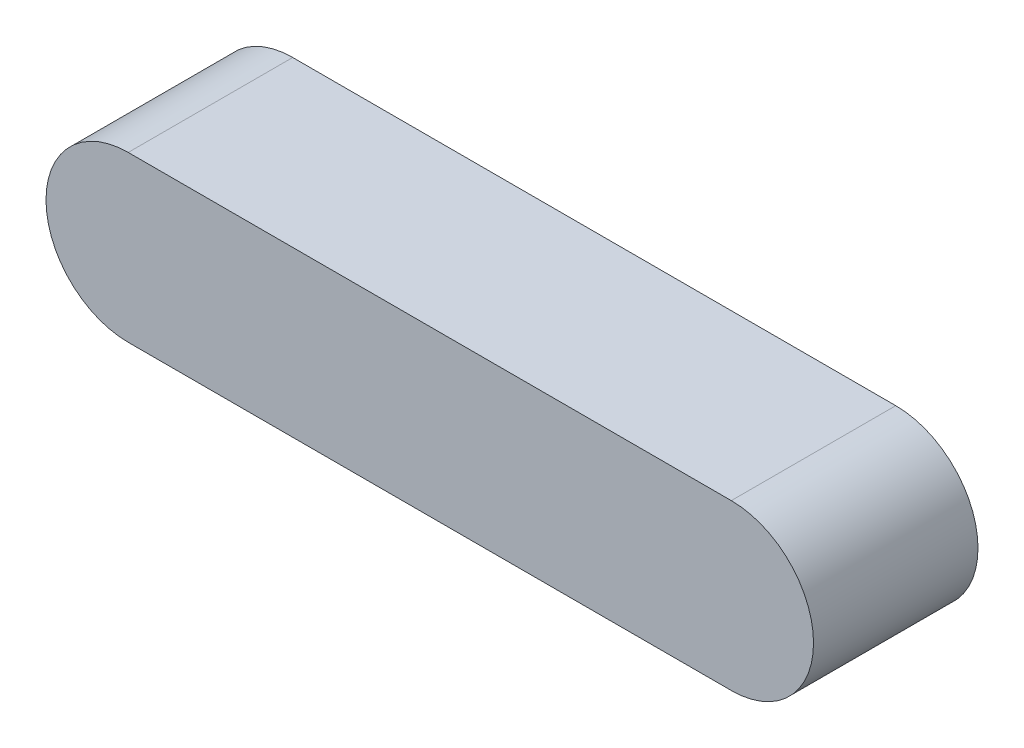
ISO-10303-21;
HEADER;
FILE_DESCRIPTION(('STEP AP214'),'2;1');
FILE_NAME('part.step','',(''),(''),'','','');
FILE_SCHEMA(('AUTOMOTIVE_DESIGN { 1 0 10303 214 1 1 1 1 }'));
ENDSEC;
DATA;
#1=APPLICATION_CONTEXT('core data for automotive mechanical design processes');
#2=APPLICATION_PROTOCOL_DEFINITION('international standard','automotive_design',2000,#1);
#3=PRODUCT_CONTEXT('',#1,'mechanical');
#4=PRODUCT('Part','Part','',(#3));
#5=PRODUCT_RELATED_PRODUCT_CATEGORY('part','',(#4));
#6=PRODUCT_DEFINITION_FORMATION('','',#4);
#7=PRODUCT_DEFINITION_CONTEXT('part definition',#1,'design');
#8=PRODUCT_DEFINITION('design','',#6,#7);
#9=PRODUCT_DEFINITION_SHAPE('','',#8);
#10=(LENGTH_UNIT() NAMED_UNIT(*) SI_UNIT(.MILLI.,.METRE.));
#11=(NAMED_UNIT(*) PLANE_ANGLE_UNIT() SI_UNIT($,.RADIAN.));
#12=(NAMED_UNIT(*) SI_UNIT($,.STERADIAN.) SOLID_ANGLE_UNIT());
#13=UNCERTAINTY_MEASURE_WITH_UNIT(LENGTH_MEASURE(1.E-05),#10,'distance_accuracy_value','');
#14=(GEOMETRIC_REPRESENTATION_CONTEXT(3) GLOBAL_UNCERTAINTY_ASSIGNED_CONTEXT((#13)) GLOBAL_UNIT_ASSIGNED_CONTEXT((#10,
#11,#12)) REPRESENTATION_CONTEXT('',''));
#15=CARTESIAN_POINT('',(0.,0.,0.));
#16=DIRECTION('',(0.,0.,1.));
#17=DIRECTION('',(1.,0.,0.));
#18=AXIS2_PLACEMENT_3D('',#15,#16,#17);
#19=CARTESIAN_POINT('',(-5.5,0.,3.));
#20=DIRECTION('',(0.,0.,-1.));
#21=DIRECTION('',(-1.,0.,0.));
#22=AXIS2_PLACEMENT_3D('',#19,#20,#21);
#23=CYLINDRICAL_SURFACE('',#22,1.5);
#24=CARTESIAN_POINT('',(-5.5,0.,0.));
#25=DIRECTION('',(0.,0.,1.));
#26=DIRECTION('',(1.,0.,0.));
#27=AXIS2_PLACEMENT_3D('',#24,#25,#26);
#28=CIRCLE('',#27,1.5);
#29=CARTESIAN_POINT('',(-5.5,1.5,0.));
#30=VERTEX_POINT('',#29);
#31=CARTESIAN_POINT('',(-5.5,-1.5,0.));
#32=VERTEX_POINT('',#31);
#33=EDGE_CURVE('E96',#30,#32,#28,.T.);
#34=ORIENTED_EDGE('',*,*,#33,.T.);
#35=DIRECTION('',(0.,0.,-1.));
#36=VECTOR('',#35,1.);
#37=CARTESIAN_POINT('',(-5.5,-1.5,3.));
#38=LINE('',#37,#36);
#39=CARTESIAN_POINT('',(-5.5,-1.5,3.));
#40=VERTEX_POINT('',#39);
#41=EDGE_CURVE('E11',#40,#32,#38,.T.);
#42=ORIENTED_EDGE('',*,*,#41,.F.);
#43=CARTESIAN_POINT('',(-5.5,0.,3.));
#44=DIRECTION('',(0.,0.,1.));
#45=DIRECTION('',(1.,0.,0.));
#46=AXIS2_PLACEMENT_3D('',#43,#44,#45);
#47=CIRCLE('',#46,1.5);
#48=CARTESIAN_POINT('',(-5.5,1.5,3.));
#49=VERTEX_POINT('',#48);
#50=EDGE_CURVE('E84',#49,#40,#47,.T.);
#51=ORIENTED_EDGE('',*,*,#50,.F.);
#52=DIRECTION('',(0.,0.,-1.));
#53=VECTOR('',#52,1.);
#54=CARTESIAN_POINT('',(-5.5,1.5,3.));
#55=LINE('',#54,#53);
#56=EDGE_CURVE('E92',#49,#30,#55,.T.);
#57=ORIENTED_EDGE('',*,*,#56,.T.);
#58=EDGE_LOOP('',(#34,#42,#51,#57));
#59=FACE_BOUND('',#58,.T.);
#60=ADVANCED_FACE('F33',(#59),#23,.T.);
#61=CARTESIAN_POINT('',(-5.5,-1.5,3.));
#62=DIRECTION('',(0.,1.,0.));
#63=DIRECTION('',(-1.,0.,0.));
#64=AXIS2_PLACEMENT_3D('',#61,#62,#63);
#65=PLANE('',#64);
#66=DIRECTION('',(1.,0.,0.));
#67=VECTOR('',#66,1.);
#68=CARTESIAN_POINT('',(-5.5,-1.5,0.));
#69=LINE('',#68,#67);
#70=CARTESIAN_POINT('',(5.5,-1.5,0.));
#71=VERTEX_POINT('',#70);
#72=EDGE_CURVE('E88',#32,#71,#69,.T.);
#73=ORIENTED_EDGE('',*,*,#72,.T.);
#74=DIRECTION('',(0.,0.,-1.));
#75=VECTOR('',#74,1.);
#76=CARTESIAN_POINT('',(5.5,-1.5,3.));
#77=LINE('',#76,#75);
#78=CARTESIAN_POINT('',(5.5,-1.5,3.));
#79=VERTEX_POINT('',#78);
#80=EDGE_CURVE('E41',#79,#71,#77,.T.);
#81=ORIENTED_EDGE('',*,*,#80,.F.);
#82=DIRECTION('',(1.,0.,0.));
#83=VECTOR('',#82,1.);
#84=CARTESIAN_POINT('',(-5.5,-1.5,3.));
#85=LINE('',#84,#83);
#86=EDGE_CURVE('E79',#40,#79,#85,.T.);
#87=ORIENTED_EDGE('',*,*,#86,.F.);
#88=ORIENTED_EDGE('',*,*,#41,.T.);
#89=EDGE_LOOP('',(#73,#81,#87,#88));
#90=FACE_BOUND('',#89,.T.);
#91=ADVANCED_FACE('F87',(#90),#65,.F.);
#92=CARTESIAN_POINT('',(5.5,0.,3.));
#93=DIRECTION('',(0.,0.,-1.));
#94=DIRECTION('',(-1.,0.,0.));
#95=AXIS2_PLACEMENT_3D('',#92,#93,#94);
#96=CYLINDRICAL_SURFACE('',#95,1.5);
#97=CARTESIAN_POINT('',(5.5,0.,0.));
#98=DIRECTION('',(0.,0.,1.));
#99=DIRECTION('',(1.,0.,0.));
#100=AXIS2_PLACEMENT_3D('',#97,#98,#99);
#101=CIRCLE('',#100,1.5);
#102=CARTESIAN_POINT('',(5.5,1.5,0.));
#103=VERTEX_POINT('',#102);
#104=EDGE_CURVE('E66',#71,#103,#101,.T.);
#105=ORIENTED_EDGE('',*,*,#104,.T.);
#106=DIRECTION('',(0.,0.,-1.));
#107=VECTOR('',#106,1.);
#108=CARTESIAN_POINT('',(5.5,1.5,3.));
#109=LINE('',#108,#107);
#110=CARTESIAN_POINT('',(5.5,1.5,3.));
#111=VERTEX_POINT('',#110);
#112=EDGE_CURVE('E89',#111,#103,#109,.T.);
#113=ORIENTED_EDGE('',*,*,#112,.F.);
#114=CARTESIAN_POINT('',(5.5,0.,3.));
#115=DIRECTION('',(0.,0.,1.));
#116=DIRECTION('',(1.,0.,0.));
#117=AXIS2_PLACEMENT_3D('',#114,#115,#116);
#118=CIRCLE('',#117,1.5);
#119=EDGE_CURVE('E82',#79,#111,#118,.T.);
#120=ORIENTED_EDGE('',*,*,#119,.F.);
#121=ORIENTED_EDGE('',*,*,#80,.T.);
#122=EDGE_LOOP('',(#105,#113,#120,#121));
#123=FACE_BOUND('',#122,.T.);
#124=ADVANCED_FACE('F90',(#123),#96,.T.);
#125=CARTESIAN_POINT('',(-5.5,1.5,3.));
#126=DIRECTION('',(0.,-1.,0.));
#127=DIRECTION('',(1.,0.,0.));
#128=AXIS2_PLACEMENT_3D('',#125,#126,#127);
#129=PLANE('',#128);
#130=DIRECTION('',(-1.,0.,0.));
#131=VECTOR('',#130,1.);
#132=CARTESIAN_POINT('',(-5.5,1.5,0.));
#133=LINE('',#132,#131);
#134=EDGE_CURVE('E72',#103,#30,#133,.T.);
#135=ORIENTED_EDGE('',*,*,#134,.T.);
#136=ORIENTED_EDGE('',*,*,#56,.F.);
#137=DIRECTION('',(-1.,0.,0.));
#138=VECTOR('',#137,1.);
#139=CARTESIAN_POINT('',(-5.5,1.5,3.));
#140=LINE('',#139,#138);
#141=EDGE_CURVE('E49',#111,#49,#140,.T.);
#142=ORIENTED_EDGE('',*,*,#141,.F.);
#143=ORIENTED_EDGE('',*,*,#112,.T.);
#144=EDGE_LOOP('',(#135,#136,#142,#143));
#145=FACE_BOUND('',#144,.T.);
#146=ADVANCED_FACE('F103',(#145),#129,.F.);
#147=CARTESIAN_POINT('',(-5.5,0.,3.));
#148=DIRECTION('',(0.,0.,1.));
#149=DIRECTION('',(1.,0.,0.));
#150=AXIS2_PLACEMENT_3D('',#147,#148,#149);
#151=PLANE('',#150);
#152=ORIENTED_EDGE('',*,*,#50,.T.);
#153=ORIENTED_EDGE('',*,*,#86,.T.);
#154=ORIENTED_EDGE('',*,*,#119,.T.);
#155=ORIENTED_EDGE('',*,*,#141,.T.);
#156=EDGE_LOOP('',(#152,#153,#154,#155));
#157=FACE_BOUND('',#156,.T.);
#158=ADVANCED_FACE('F80',(#157),#151,.T.);
#159=CARTESIAN_POINT('',(-5.5,0.,0.));
#160=DIRECTION('',(0.,0.,1.));
#161=DIRECTION('',(1.,0.,0.));
#162=AXIS2_PLACEMENT_3D('',#159,#160,#161);
#163=PLANE('',#162);
#164=ORIENTED_EDGE('',*,*,#33,.F.);
#165=ORIENTED_EDGE('',*,*,#134,.F.);
#166=ORIENTED_EDGE('',*,*,#104,.F.);
#167=ORIENTED_EDGE('',*,*,#72,.F.);
#168=EDGE_LOOP('',(#164,#165,#166,#167));
#169=FACE_BOUND('',#168,.T.);
#170=ADVANCED_FACE('F106',(#169),#163,.F.);
#171=CLOSED_SHELL('',(#60,#91,#124,#146,#158,#170));
#172=MANIFOLD_SOLID_BREP('B2',#171);
#173=ADVANCED_BREP_SHAPE_REPRESENTATION('',(#18,#172),#14);
#174=SHAPE_DEFINITION_REPRESENTATION(#9,#173);
ENDSEC;
END-ISO-10303-21;
